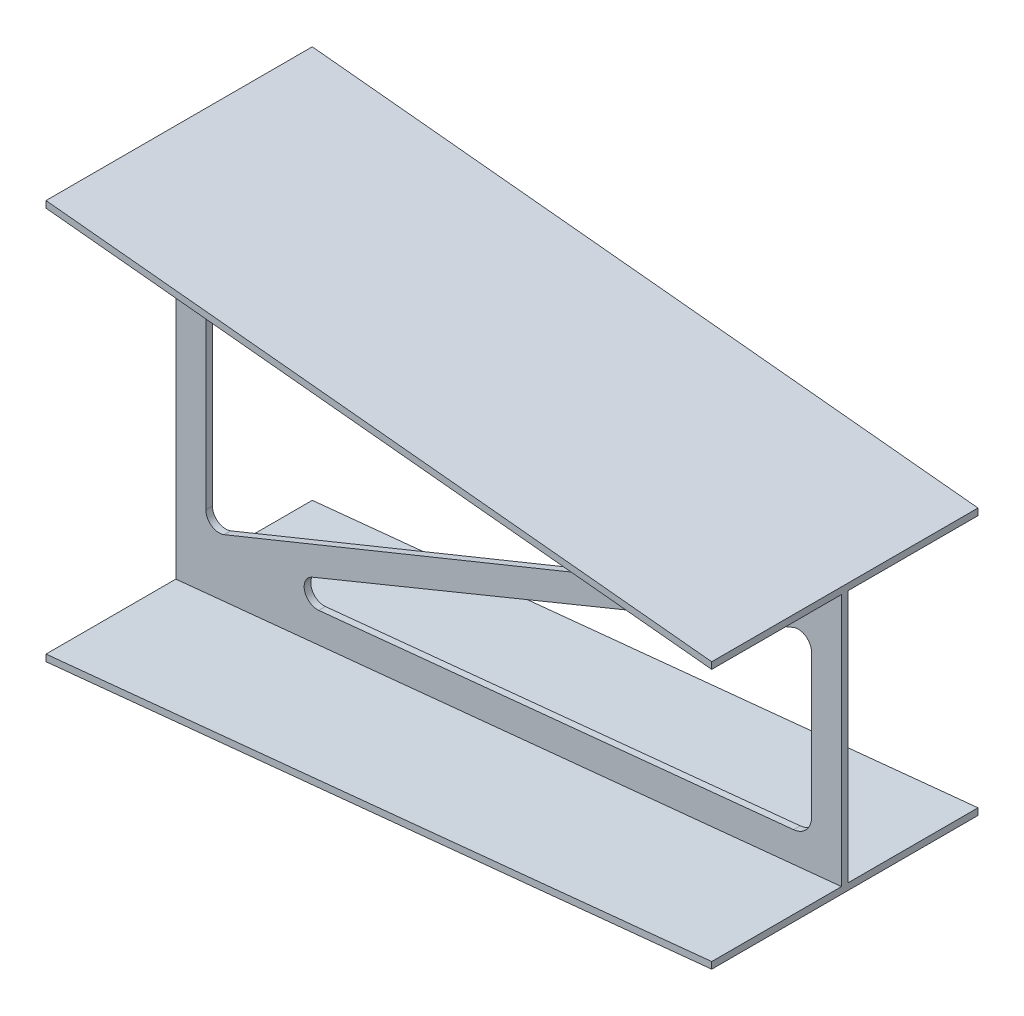
ISO-10303-21;
HEADER;
FILE_DESCRIPTION(('STEP AP214'),'2;1');
FILE_NAME('part.step','',(''),(''),'','','');
FILE_SCHEMA(('AUTOMOTIVE_DESIGN { 1 0 10303 214 1 1 1 1 }'));
ENDSEC;
DATA;
#1=APPLICATION_CONTEXT('core data for automotive mechanical design processes');
#2=APPLICATION_PROTOCOL_DEFINITION('international standard','automotive_design',2000,#1);
#3=PRODUCT_CONTEXT('',#1,'mechanical');
#4=PRODUCT('Part','Part','',(#3));
#5=PRODUCT_RELATED_PRODUCT_CATEGORY('part','',(#4));
#6=PRODUCT_DEFINITION_FORMATION('','',#4);
#7=PRODUCT_DEFINITION_CONTEXT('part definition',#1,'design');
#8=PRODUCT_DEFINITION('design','',#6,#7);
#9=PRODUCT_DEFINITION_SHAPE('','',#8);
#10=(LENGTH_UNIT() NAMED_UNIT(*) SI_UNIT(.MILLI.,.METRE.));
#11=(NAMED_UNIT(*) PLANE_ANGLE_UNIT() SI_UNIT($,.RADIAN.));
#12=(NAMED_UNIT(*) SI_UNIT($,.STERADIAN.) SOLID_ANGLE_UNIT());
#13=UNCERTAINTY_MEASURE_WITH_UNIT(LENGTH_MEASURE(1.E-05),#10,'distance_accuracy_value','');
#14=(GEOMETRIC_REPRESENTATION_CONTEXT(3) GLOBAL_UNCERTAINTY_ASSIGNED_CONTEXT((#13)) GLOBAL_UNIT_ASSIGNED_CONTEXT((#10,
#11,#12)) REPRESENTATION_CONTEXT('',''));
#15=CARTESIAN_POINT('',(0.,0.,0.));
#16=DIRECTION('',(0.,0.,1.));
#17=DIRECTION('',(1.,0.,0.));
#18=AXIS2_PLACEMENT_3D('',#15,#16,#17);
#19=CARTESIAN_POINT('',(0.,0.,10.0000000000001));
#20=DIRECTION('',(0.,0.,1.));
#21=DIRECTION('',(1.,0.,0.));
#22=AXIS2_PLACEMENT_3D('',#19,#20,#21);
#23=PLANE('',#22);
#24=DIRECTION('',(0.,-1.,0.));
#25=VECTOR('',#24,1.);
#26=CARTESIAN_POINT('',(45.0000000000001,0.,10.0000000000002));
#27=LINE('',#26,#25);
#28=CARTESIAN_POINT('',(45.,207.125932841593,10.0000000000002));
#29=VERTEX_POINT('',#28);
#30=CARTESIAN_POINT('',(45.0000000000002,-177.401369053888,10.0000000000002));
#31=VERTEX_POINT('',#30);
#32=EDGE_CURVE('E390',#29,#31,#27,.T.);
#33=ORIENTED_EDGE('',*,*,#32,.F.);
#34=CARTESIAN_POINT('',(75.,207.125932841593,10.0000000000002));
#35=DIRECTION('',(0.,0.,1.));
#36=DIRECTION('',(1.,0.,0.));
#37=AXIS2_PLACEMENT_3D('',#34,#35,#36);
#38=CIRCLE('',#37,30.);
#39=CARTESIAN_POINT('',(77.9851115706299,236.977048547893,10.0000000000002));
#40=VERTEX_POINT('',#39);
#41=EDGE_CURVE('E387',#40,#29,#38,.T.);
#42=ORIENTED_EDGE('',*,*,#41,.F.);
#43=DIRECTION('',(-0.995037190209989,0.0995037190209982,0.));
#44=VECTOR('',#43,1.);
#45=CARTESIAN_POINT('',(24.2352039311836,242.352039311838,10.0000000000001));
#46=LINE('',#45,#44);
#47=CARTESIAN_POINT('',(847.695467731229,160.006012931834,10.0000000000002));
#48=VERTEX_POINT('',#47);
#49=EDGE_CURVE('E384',#48,#40,#46,.T.);
#50=ORIENTED_EDGE('',*,*,#49,.F.);
#51=CARTESIAN_POINT('',(845.705393350809,140.105269127634,10.0000000000002));
#52=DIRECTION('',(0.,0.,1.));
#53=DIRECTION('',(1.,0.,0.));
#54=AXIS2_PLACEMENT_3D('',#51,#52,#53);
#55=CIRCLE('',#54,20.);
#56=CARTESIAN_POINT('',(853.239962448429,121.578794327684,10.0000000000002));
#57=VERTEX_POINT('',#56);
#58=EDGE_CURVE('E381',#57,#48,#55,.T.);
#59=ORIENTED_EDGE('',*,*,#58,.F.);
#60=DIRECTION('',(0.926323739997497,0.376728454881033,0.));
#61=VECTOR('',#60,1.);
#62=CARTESIAN_POINT('',(78.6678517290491,-193.433486871156,10.0000000000002));
#63=LINE('',#62,#61);
#64=CARTESIAN_POINT('',(72.5345690976208,-195.927843853838,10.0000000000002));
#65=VERTEX_POINT('',#64);
#66=EDGE_CURVE('E378',#65,#57,#63,.T.);
#67=ORIENTED_EDGE('',*,*,#66,.F.);
#68=CARTESIAN_POINT('',(65.0000000000002,-177.401369053888,10.0000000000002));
#69=DIRECTION('',(0.,0.,1.));
#70=DIRECTION('',(1.,0.,0.));
#71=AXIS2_PLACEMENT_3D('',#68,#69,#70);
#72=CIRCLE('',#71,20.);
#73=EDGE_CURVE('E321',#31,#65,#72,.T.);
#74=ORIENTED_EDGE('',*,*,#73,.F.);
#75=EDGE_LOOP('',(#33,#42,#50,#59,#67,#74));
#76=FACE_BOUND('',#75,.T.);
#77=DIRECTION('',(0.995037190209989,0.0995037190209988,0.));
#78=VECTOR('',#77,1.);
#79=CARTESIAN_POINT('',(0.,-290.,10.0000000000001));
#80=LINE('',#79,#78);
#81=CARTESIAN_POINT('',(0.,-290.,10.0000000000001));
#82=VERTEX_POINT('',#81);
#83=CARTESIAN_POINT('',(1000.,-190.,10.0000000000002));
#84=VERTEX_POINT('',#83);
#85=EDGE_CURVE('E511',#82,#84,#80,.T.);
#86=ORIENTED_EDGE('',*,*,#85,.T.);
#87=DIRECTION('',(0.,1.,0.));
#88=VECTOR('',#87,1.);
#89=CARTESIAN_POINT('',(1000.,190.,10.0000000000002));
#90=LINE('',#89,#88);
#91=CARTESIAN_POINT('',(1000.,190.,10.0000000000002));
#92=VERTEX_POINT('',#91);
#93=EDGE_CURVE('E1156',#84,#92,#90,.T.);
#94=ORIENTED_EDGE('',*,*,#93,.T.);
#95=DIRECTION('',(0.995037190209989,-0.0995037190209988,0.));
#96=VECTOR('',#95,1.);
#97=CARTESIAN_POINT('',(0.,290.,10.0000000000001));
#98=LINE('',#97,#96);
#99=CARTESIAN_POINT('',(0.,290.,10.0000000000001));
#100=VERTEX_POINT('',#99);
#101=EDGE_CURVE('E502',#100,#92,#98,.T.);
#102=ORIENTED_EDGE('',*,*,#101,.F.);
#103=DIRECTION('',(0.,-1.,0.));
#104=VECTOR('',#103,1.);
#105=CARTESIAN_POINT('',(0.,290.,10.0000000000001));
#106=LINE('',#105,#104);
#107=EDGE_CURVE('E519',#100,#82,#106,.T.);
#108=ORIENTED_EDGE('',*,*,#107,.T.);
#109=EDGE_LOOP('',(#86,#94,#102,#108));
#110=FACE_BOUND('',#109,.T.);
#111=CARTESIAN_POINT('',(925.,-122.125932841594,10.0000000000002));
#112=DIRECTION('',(0.,0.,1.));
#113=DIRECTION('',(1.,0.,0.));
#114=AXIS2_PLACEMENT_3D('',#111,#112,#113);
#115=CIRCLE('',#114,30.);
#116=CARTESIAN_POINT('',(955.,-122.125932841594,10.0000000000002));
#117=VERTEX_POINT('',#116);
#118=CARTESIAN_POINT('',(927.98511157063,-151.977048547894,10.0000000000002));
#119=VERTEX_POINT('',#118);
#120=EDGE_CURVE('E406',#117,#119,#115,.F.);
#121=ORIENTED_EDGE('',*,*,#120,.T.);
#122=DIRECTION('',(-0.995037190209989,-0.0995037190209976,0.));
#123=VECTOR('',#122,1.);
#124=CARTESIAN_POINT('',(24.2352039311834,-242.352039311837,10.0000000000001));
#125=LINE('',#124,#123);
#126=CARTESIAN_POINT('',(214.762635295755,-223.29929617538,10.0000000000002));
#127=VERTEX_POINT('',#126);
#128=EDGE_CURVE('E410',#119,#127,#125,.T.);
#129=ORIENTED_EDGE('',*,*,#128,.T.);
#130=CARTESIAN_POINT('',(212.772560915335,-203.39855237118,10.0000000000002));
#131=DIRECTION('',(0.,0.,1.));
#132=DIRECTION('',(1.,0.,0.));
#133=AXIS2_PLACEMENT_3D('',#130,#131,#132);
#134=CIRCLE('',#133,20.);
#135=CARTESIAN_POINT('',(205.194043996068,-184.890011604702,10.0000000000002));
#136=VERTEX_POINT('',#135);
#137=EDGE_CURVE('E393',#127,#136,#134,.F.);
#138=ORIENTED_EDGE('',*,*,#137,.T.);
#139=DIRECTION('',(0.925427038323906,0.378925845963355,0.));
#140=VECTOR('',#139,1.);
#141=CARTESIAN_POINT('',(94.297796988303,-230.29764772444,10.0000000000002));
#142=LINE('',#141,#140);
#143=CARTESIAN_POINT('',(927.421483080733,110.833618676044,10.0000000000002));
#144=VERTEX_POINT('',#143);
#145=EDGE_CURVE('E240',#136,#144,#142,.T.);
#146=ORIENTED_EDGE('',*,*,#145,.T.);
#147=CARTESIAN_POINT('',(935.,92.3250779095655,10.0000000000002));
#148=DIRECTION('',(0.,0.,1.));
#149=DIRECTION('',(1.,0.,0.));
#150=AXIS2_PLACEMENT_3D('',#147,#148,#149);
#151=CIRCLE('',#150,20.);
#152=CARTESIAN_POINT('',(955.000000000001,92.3250779095655,10.0000000000002));
#153=VERTEX_POINT('',#152);
#154=EDGE_CURVE('E398',#144,#153,#151,.F.);
#155=ORIENTED_EDGE('',*,*,#154,.T.);
#156=DIRECTION('',(0.,-1.,0.));
#157=VECTOR('',#156,1.);
#158=CARTESIAN_POINT('',(955.,-2.47204008226222E-12,10.0000000000002));
#159=LINE('',#158,#157);
#160=EDGE_CURVE('E402',#153,#117,#159,.T.);
#161=ORIENTED_EDGE('',*,*,#160,.T.);
#162=EDGE_LOOP('',(#121,#129,#138,#146,#155,#161));
#163=FACE_BOUND('',#162,.T.);
#164=ADVANCED_FACE('F69',(#76,#110,#163),#23,.T.);
#165=CARTESIAN_POINT('',(0.,0.,-1.57859836313889E-13));
#166=DIRECTION('',(0.,0.,-1.));
#167=DIRECTION('',(-1.,0.,0.));
#168=AXIS2_PLACEMENT_3D('',#165,#166,#167);
#169=PLANE('',#168);
#170=DIRECTION('',(0.,-1.,0.));
#171=VECTOR('',#170,1.);
#172=CARTESIAN_POINT('',(45.0000000000002,-177.401369053888,-1.30772129236512E-13));
#173=LINE('',#172,#171);
#174=CARTESIAN_POINT('',(45.,207.125932841593,-1.29378568044144E-13));
#175=VERTEX_POINT('',#174);
#176=CARTESIAN_POINT('',(45.0000000000002,-177.401369053888,-1.3138506486469E-13));
#177=VERTEX_POINT('',#176);
#178=EDGE_CURVE('E309',#175,#177,#173,.T.);
#179=ORIENTED_EDGE('',*,*,#178,.T.);
#180=CARTESIAN_POINT('',(65.0000000000002,-177.401369053888,-1.18733148313232E-13));
#181=DIRECTION('',(0.,0.,1.));
#182=DIRECTION('',(1.,0.,0.));
#183=AXIS2_PLACEMENT_3D('',#180,#181,#182);
#184=CIRCLE('',#183,20.);
#185=CARTESIAN_POINT('',(72.5345690976208,-195.927843853838,-1.14197721631663E-13));
#186=VERTEX_POINT('',#185);
#187=EDGE_CURVE('E317',#177,#186,#184,.T.);
#188=ORIENTED_EDGE('',*,*,#187,.T.);
#189=DIRECTION('',(0.926323739997497,0.376728454881033,0.));
#190=VECTOR('',#189,1.);
#191=CARTESIAN_POINT('',(72.5345690976208,-195.927843853838,-1.14197721631663E-13));
#192=LINE('',#191,#190);
#193=CARTESIAN_POINT('',(853.239962448429,121.578794327684,3.52723527443196E-13));
#194=VERTEX_POINT('',#193);
#195=EDGE_CURVE('E322',#186,#194,#192,.T.);
#196=ORIENTED_EDGE('',*,*,#195,.T.);
#197=CARTESIAN_POINT('',(845.705393350809,140.105269127634,3.5121171854934E-13));
#198=DIRECTION('',(0.,0.,1.));
#199=DIRECTION('',(-1.,0.,0.));
#200=AXIS2_PLACEMENT_3D('',#197,#198,#199);
#201=CIRCLE('',#200,20.);
#202=CARTESIAN_POINT('',(847.695467731229,160.006012931834,3.52010334132733E-13));
#203=VERTEX_POINT('',#202);
#204=EDGE_CURVE('E329',#194,#203,#201,.T.);
#205=ORIENTED_EDGE('',*,*,#204,.T.);
#206=DIRECTION('',(-0.995037190209989,0.0995037190209982,0.));
#207=VECTOR('',#206,1.);
#208=CARTESIAN_POINT('',(77.9851115706299,236.977048547893,-1.10916772788959E-13));
#209=LINE('',#208,#207);
#210=CARTESIAN_POINT('',(77.9851115706299,236.977048547893,-1.11194101831607E-13));
#211=VERTEX_POINT('',#210);
#212=EDGE_CURVE('E341',#203,#211,#209,.T.);
#213=ORIENTED_EDGE('',*,*,#212,.T.);
#214=CARTESIAN_POINT('',(75.,207.125932841593,-1.12713657851593E-13));
#215=DIRECTION('',(0.,0.,1.));
#216=DIRECTION('',(-1.,0.,0.));
#217=AXIS2_PLACEMENT_3D('',#214,#215,#216);
#218=CIRCLE('',#217,30.);
#219=EDGE_CURVE('E353',#211,#175,#218,.T.);
#220=ORIENTED_EDGE('',*,*,#219,.T.);
#221=EDGE_LOOP('',(#179,#188,#196,#205,#213,#220));
#222=FACE_BOUND('',#221,.T.);
#223=DIRECTION('',(0.995037190209989,-0.0995037190209988,0.));
#224=VECTOR('',#223,1.);
#225=CARTESIAN_POINT('',(0.,290.,-1.57859836313889E-13));
#226=LINE('',#225,#224);
#227=CARTESIAN_POINT('',(0.,290.,-1.57859836313889E-13));
#228=VERTEX_POINT('',#227);
#229=CARTESIAN_POINT('',(1000.,190.,4.44089209850063E-13));
#230=VERTEX_POINT('',#229);
#231=EDGE_CURVE('E660',#228,#230,#226,.T.);
#232=ORIENTED_EDGE('',*,*,#231,.T.);
#233=DIRECTION('',(0.,-1.,0.));
#234=VECTOR('',#233,1.);
#235=CARTESIAN_POINT('',(1000.,190.,4.44089209850063E-13));
#236=LINE('',#235,#234);
#237=CARTESIAN_POINT('',(1000.,-190.,4.44089209850063E-13));
#238=VERTEX_POINT('',#237);
#239=EDGE_CURVE('E870',#230,#238,#236,.T.);
#240=ORIENTED_EDGE('',*,*,#239,.T.);
#241=DIRECTION('',(0.995037190209989,0.0995037190209988,0.));
#242=VECTOR('',#241,1.);
#243=CARTESIAN_POINT('',(0.,-290.,-1.57859836313889E-13));
#244=LINE('',#243,#242);
#245=CARTESIAN_POINT('',(0.,-290.,-1.57859836313889E-13));
#246=VERTEX_POINT('',#245);
#247=EDGE_CURVE('E639',#246,#238,#244,.T.);
#248=ORIENTED_EDGE('',*,*,#247,.F.);
#249=DIRECTION('',(0.,1.,0.));
#250=VECTOR('',#249,1.);
#251=CARTESIAN_POINT('',(0.,290.,-1.57859836313889E-13));
#252=LINE('',#251,#250);
#253=EDGE_CURVE('E667',#246,#228,#252,.T.);
#254=ORIENTED_EDGE('',*,*,#253,.T.);
#255=EDGE_LOOP('',(#232,#240,#248,#254));
#256=FACE_BOUND('',#255,.T.);
#257=CARTESIAN_POINT('',(212.772560915335,-203.39855237118,0.));
#258=DIRECTION('',(0.,0.,-1.));
#259=DIRECTION('',(-1.,0.,0.));
#260=AXIS2_PLACEMENT_3D('',#257,#258,#259);
#261=CIRCLE('',#260,20.);
#262=CARTESIAN_POINT('',(214.762635295755,-223.29929617538,0.));
#263=VERTEX_POINT('',#262);
#264=CARTESIAN_POINT('',(205.194043996068,-184.890011604702,0.));
#265=VERTEX_POINT('',#264);
#266=EDGE_CURVE('E247',#263,#265,#261,.T.);
#267=ORIENTED_EDGE('',*,*,#266,.F.);
#268=DIRECTION('',(-0.995037190209989,-0.0995037190209975,0.));
#269=VECTOR('',#268,1.);
#270=CARTESIAN_POINT('',(927.98511157063,-151.977048547894,4.007399164504E-13));
#271=LINE('',#270,#269);
#272=CARTESIAN_POINT('',(927.98511157063,-151.977048547894,4.00140954762855E-13));
#273=VERTEX_POINT('',#272);
#274=EDGE_CURVE('E303',#273,#263,#271,.T.);
#275=ORIENTED_EDGE('',*,*,#274,.F.);
#276=CARTESIAN_POINT('',(925.,-122.125932841594,3.98943031387766E-13));
#277=DIRECTION('',(0.,0.,-1.));
#278=DIRECTION('',(-1.,0.,0.));
#279=AXIS2_PLACEMENT_3D('',#276,#277,#278);
#280=CIRCLE('',#279,30.);
#281=CARTESIAN_POINT('',(955.,-122.125932841594,4.04962521849406E-13));
#282=VERTEX_POINT('',#281);
#283=EDGE_CURVE('E280',#282,#273,#280,.T.);
#284=ORIENTED_EDGE('',*,*,#283,.F.);
#285=DIRECTION('',(0.,-1.,0.));
#286=VECTOR('',#285,1.);
#287=CARTESIAN_POINT('',(955.000000000001,92.3250779095655,4.17001502772685E-13));
#288=LINE('',#287,#286);
#289=CARTESIAN_POINT('',(955.000000000001,92.3250779095655,4.12988509131592E-13));
#290=VERTEX_POINT('',#289);
#291=EDGE_CURVE('E269',#290,#282,#288,.T.);
#292=ORIENTED_EDGE('',*,*,#291,.F.);
#293=CARTESIAN_POINT('',(935.,92.3250779095655,4.04962521849406E-13));
#294=DIRECTION('',(0.,0.,-1.));
#295=DIRECTION('',(-1.,0.,0.));
#296=AXIS2_PLACEMENT_3D('',#293,#294,#295);
#297=CIRCLE('',#296,20.);
#298=CARTESIAN_POINT('',(927.421483080733,110.833618676044,4.03441894839109E-13));
#299=VERTEX_POINT('',#298);
#300=EDGE_CURVE('E243',#299,#290,#297,.T.);
#301=ORIENTED_EDGE('',*,*,#300,.F.);
#302=DIRECTION('',(0.925427038323906,0.378925845963355,0.));
#303=VECTOR('',#302,1.);
#304=CARTESIAN_POINT('',(927.421483080733,110.833618676044,4.00400640818516E-13));
#305=LINE('',#304,#303);
#306=EDGE_CURVE('E237',#265,#299,#305,.T.);
#307=ORIENTED_EDGE('',*,*,#306,.F.);
#308=EDGE_LOOP('',(#267,#275,#284,#292,#301,#307));
#309=FACE_BOUND('',#308,.T.);
#310=ADVANCED_FACE('F256',(#222,#256,#309),#169,.T.);
#311=CARTESIAN_POINT('',(1000.,0.,0.));
#312=DIRECTION('',(-1.,0.,0.));
#313=DIRECTION('',(0.,0.,1.));
#314=AXIS2_PLACEMENT_3D('',#311,#312,#313);
#315=PLANE('',#314);
#316=DIRECTION('',(0.,-1.,0.));
#317=VECTOR('',#316,1.);
#318=CARTESIAN_POINT('',(1000.,200.,-195.));
#319=LINE('',#318,#317);
#320=CARTESIAN_POINT('',(1000.,200.,-195.));
#321=VERTEX_POINT('',#320);
#322=CARTESIAN_POINT('',(1000.,190.,-195.));
#323=VERTEX_POINT('',#322);
#324=EDGE_CURVE('E713',#321,#323,#319,.T.);
#325=ORIENTED_EDGE('',*,*,#324,.F.);
#326=DIRECTION('',(0.,0.,-1.));
#327=VECTOR('',#326,1.);
#328=CARTESIAN_POINT('',(1000.,200.,-195.));
#329=LINE('',#328,#327);
#330=CARTESIAN_POINT('',(1000.,200.,205.));
#331=VERTEX_POINT('',#330);
#332=EDGE_CURVE('E13',#331,#321,#329,.T.);
#333=ORIENTED_EDGE('',*,*,#332,.F.);
#334=DIRECTION('',(0.,1.,0.));
#335=VECTOR('',#334,1.);
#336=CARTESIAN_POINT('',(1000.,200.,205.));
#337=LINE('',#336,#335);
#338=CARTESIAN_POINT('',(1000.,190.,205.));
#339=VERTEX_POINT('',#338);
#340=EDGE_CURVE('E81',#339,#331,#337,.T.);
#341=ORIENTED_EDGE('',*,*,#340,.F.);
#342=DIRECTION('',(0.,0.,1.));
#343=VECTOR('',#342,1.);
#344=CARTESIAN_POINT('',(1000.,190.,10.0000000000002));
#345=LINE('',#344,#343);
#346=EDGE_CURVE('E471',#92,#339,#345,.T.);
#347=ORIENTED_EDGE('',*,*,#346,.F.);
#348=ORIENTED_EDGE('',*,*,#93,.F.);
#349=DIRECTION('',(0.,0.,-1.));
#350=VECTOR('',#349,1.);
#351=CARTESIAN_POINT('',(1000.,-190.,10.0000000000002));
#352=LINE('',#351,#350);
#353=CARTESIAN_POINT('',(1000.,-190.,205.));
#354=VERTEX_POINT('',#353);
#355=EDGE_CURVE('E1146',#354,#84,#352,.T.);
#356=ORIENTED_EDGE('',*,*,#355,.F.);
#357=DIRECTION('',(0.,1.,0.));
#358=VECTOR('',#357,1.);
#359=CARTESIAN_POINT('',(1000.,-190.,205.));
#360=LINE('',#359,#358);
#361=CARTESIAN_POINT('',(1000.,-200.,205.));
#362=VERTEX_POINT('',#361);
#363=EDGE_CURVE('E1137',#362,#354,#360,.T.);
#364=ORIENTED_EDGE('',*,*,#363,.F.);
#365=DIRECTION('',(0.,0.,1.));
#366=VECTOR('',#365,1.);
#367=CARTESIAN_POINT('',(1000.,-200.,-195.));
#368=LINE('',#367,#366);
#369=CARTESIAN_POINT('',(1000.,-200.,-195.));
#370=VERTEX_POINT('',#369);
#371=EDGE_CURVE('E591',#370,#362,#368,.T.);
#372=ORIENTED_EDGE('',*,*,#371,.F.);
#373=DIRECTION('',(0.,-1.,0.));
#374=VECTOR('',#373,1.);
#375=CARTESIAN_POINT('',(1000.,-190.,-195.));
#376=LINE('',#375,#374);
#377=CARTESIAN_POINT('',(1000.,-190.,-195.));
#378=VERTEX_POINT('',#377);
#379=EDGE_CURVE('E605',#378,#370,#376,.T.);
#380=ORIENTED_EDGE('',*,*,#379,.F.);
#381=DIRECTION('',(0.,0.,-1.));
#382=VECTOR('',#381,1.);
#383=CARTESIAN_POINT('',(1000.,-190.,-195.));
#384=LINE('',#383,#382);
#385=EDGE_CURVE('E1112',#238,#378,#384,.T.);
#386=ORIENTED_EDGE('',*,*,#385,.F.);
#387=ORIENTED_EDGE('',*,*,#239,.F.);
#388=DIRECTION('',(0.,0.,1.));
#389=VECTOR('',#388,1.);
#390=CARTESIAN_POINT('',(1000.,190.,-195.));
#391=LINE('',#390,#389);
#392=EDGE_CURVE('E699',#323,#230,#391,.T.);
#393=ORIENTED_EDGE('',*,*,#392,.F.);
#394=EDGE_LOOP('',(#325,#333,#341,#347,#348,#356,#364,#372,#380,#386,#387,#393));
#395=FACE_BOUND('',#394,.T.);
#396=ADVANCED_FACE('F71',(#395),#315,.F.);
#397=CARTESIAN_POINT('',(0.,0.,0.));
#398=DIRECTION('',(1.,0.,0.));
#399=DIRECTION('',(0.,0.,-1.));
#400=AXIS2_PLACEMENT_3D('',#397,#398,#399);
#401=PLANE('',#400);
#402=DIRECTION('',(0.,-1.,0.));
#403=VECTOR('',#402,1.);
#404=CARTESIAN_POINT('',(0.,300.,205.));
#405=LINE('',#404,#403);
#406=CARTESIAN_POINT('',(0.,300.,205.));
#407=VERTEX_POINT('',#406);
#408=CARTESIAN_POINT('',(0.,290.,205.));
#409=VERTEX_POINT('',#408);
#410=EDGE_CURVE('E414',#407,#409,#405,.T.);
#411=ORIENTED_EDGE('',*,*,#410,.F.);
#412=DIRECTION('',(0.,0.,1.));
#413=VECTOR('',#412,1.);
#414=CARTESIAN_POINT('',(0.,300.,205.));
#415=LINE('',#414,#413);
#416=CARTESIAN_POINT('',(0.,300.,-195.));
#417=VERTEX_POINT('',#416);
#418=EDGE_CURVE('E420',#417,#407,#415,.T.);
#419=ORIENTED_EDGE('',*,*,#418,.F.);
#420=DIRECTION('',(0.,1.,0.));
#421=VECTOR('',#420,1.);
#422=CARTESIAN_POINT('',(0.,300.,-195.));
#423=LINE('',#422,#421);
#424=CARTESIAN_POINT('',(0.,290.,-195.));
#425=VERTEX_POINT('',#424);
#426=EDGE_CURVE('E729',#425,#417,#423,.T.);
#427=ORIENTED_EDGE('',*,*,#426,.F.);
#428=DIRECTION('',(0.,0.,-1.));
#429=VECTOR('',#428,1.);
#430=CARTESIAN_POINT('',(0.,290.,-1.57859836313889E-13));
#431=LINE('',#430,#429);
#432=EDGE_CURVE('E843',#228,#425,#431,.T.);
#433=ORIENTED_EDGE('',*,*,#432,.F.);
#434=ORIENTED_EDGE('',*,*,#253,.F.);
#435=DIRECTION('',(0.,0.,1.));
#436=VECTOR('',#435,1.);
#437=CARTESIAN_POINT('',(0.,-290.,-1.57859836313889E-13));
#438=LINE('',#437,#436);
#439=CARTESIAN_POINT('',(0.,-290.,-195.));
#440=VERTEX_POINT('',#439);
#441=EDGE_CURVE('E648',#440,#246,#438,.T.);
#442=ORIENTED_EDGE('',*,*,#441,.F.);
#443=DIRECTION('',(0.,1.,0.));
#444=VECTOR('',#443,1.);
#445=CARTESIAN_POINT('',(0.,-290.,-195.));
#446=LINE('',#445,#444);
#447=CARTESIAN_POINT('',(0.,-300.,-195.));
#448=VERTEX_POINT('',#447);
#449=EDGE_CURVE('E833',#448,#440,#446,.T.);
#450=ORIENTED_EDGE('',*,*,#449,.F.);
#451=DIRECTION('',(0.,0.,-1.));
#452=VECTOR('',#451,1.);
#453=CARTESIAN_POINT('',(0.,-300.,205.));
#454=LINE('',#453,#452);
#455=CARTESIAN_POINT('',(0.,-300.,205.));
#456=VERTEX_POINT('',#455);
#457=EDGE_CURVE('E828',#456,#448,#454,.T.);
#458=ORIENTED_EDGE('',*,*,#457,.F.);
#459=DIRECTION('',(0.,-1.,0.));
#460=VECTOR('',#459,1.);
#461=CARTESIAN_POINT('',(0.,-290.,205.));
#462=LINE('',#461,#460);
#463=CARTESIAN_POINT('',(0.,-290.,205.));
#464=VERTEX_POINT('',#463);
#465=EDGE_CURVE('E556',#464,#456,#462,.T.);
#466=ORIENTED_EDGE('',*,*,#465,.F.);
#467=DIRECTION('',(0.,0.,1.));
#468=VECTOR('',#467,1.);
#469=CARTESIAN_POINT('',(0.,-290.,205.));
#470=LINE('',#469,#468);
#471=EDGE_CURVE('E537',#82,#464,#470,.T.);
#472=ORIENTED_EDGE('',*,*,#471,.F.);
#473=ORIENTED_EDGE('',*,*,#107,.F.);
#474=DIRECTION('',(0.,0.,-1.));
#475=VECTOR('',#474,1.);
#476=CARTESIAN_POINT('',(0.,290.,205.));
#477=LINE('',#476,#475);
#478=EDGE_CURVE('E812',#409,#100,#477,.T.);
#479=ORIENTED_EDGE('',*,*,#478,.F.);
#480=EDGE_LOOP('',(#411,#419,#427,#433,#434,#442,#450,#458,#466,#472,#473,#479));
#481=FACE_BOUND('',#480,.T.);
#482=ADVANCED_FACE('F489',(#481),#401,.F.);
#483=CARTESIAN_POINT('',(28.7128712871287,287.128712871287,0.));
#484=DIRECTION('',(-0.0995037190209988,-0.995037190209989,0.));
#485=DIRECTION('',(0.995037190209989,-0.0995037190209988,0.));
#486=AXIS2_PLACEMENT_3D('',#483,#484,#485);
#487=PLANE('',#486);
#488=ORIENTED_EDGE('',*,*,#101,.T.);
#489=ORIENTED_EDGE('',*,*,#346,.T.);
#490=DIRECTION('',(0.995037190209989,-0.0995037190209988,0.));
#491=VECTOR('',#490,1.);
#492=CARTESIAN_POINT('',(0.,290.,205.));
#493=LINE('',#492,#491);
#494=EDGE_CURVE('E856',#409,#339,#493,.T.);
#495=ORIENTED_EDGE('',*,*,#494,.F.);
#496=ORIENTED_EDGE('',*,*,#478,.T.);
#497=EDGE_LOOP('',(#488,#489,#495,#496));
#498=FACE_BOUND('',#497,.T.);
#499=ADVANCED_FACE('F478',(#498),#487,.T.);
#500=CARTESIAN_POINT('',(28.7128712871287,-287.128712871287,0.));
#501=DIRECTION('',(-0.0995037190209989,0.995037190209989,0.));
#502=DIRECTION('',(-0.995037190209989,-0.0995037190209989,0.));
#503=AXIS2_PLACEMENT_3D('',#500,#501,#502);
#504=PLANE('',#503);
#505=DIRECTION('',(0.995037190209989,0.0995037190209989,0.));
#506=VECTOR('',#505,1.);
#507=CARTESIAN_POINT('',(0.,-290.,205.));
#508=LINE('',#507,#506);
#509=EDGE_CURVE('E510',#464,#354,#508,.T.);
#510=ORIENTED_EDGE('',*,*,#509,.T.);
#511=ORIENTED_EDGE('',*,*,#355,.T.);
#512=ORIENTED_EDGE('',*,*,#85,.F.);
#513=ORIENTED_EDGE('',*,*,#471,.T.);
#514=EDGE_LOOP('',(#510,#511,#512,#513));
#515=FACE_BOUND('',#514,.T.);
#516=ADVANCED_FACE('F488',(#515),#504,.T.);
#517=CARTESIAN_POINT('',(0.,0.,205.));
#518=DIRECTION('',(0.,0.,1.));
#519=DIRECTION('',(1.,0.,0.));
#520=AXIS2_PLACEMENT_3D('',#517,#518,#519);
#521=PLANE('',#520);
#522=DIRECTION('',(0.995037190209989,0.0995037190209989,0.));
#523=VECTOR('',#522,1.);
#524=CARTESIAN_POINT('',(0.,-300.,205.));
#525=LINE('',#524,#523);
#526=EDGE_CURVE('E549',#456,#362,#525,.T.);
#527=ORIENTED_EDGE('',*,*,#526,.T.);
#528=ORIENTED_EDGE('',*,*,#363,.T.);
#529=ORIENTED_EDGE('',*,*,#509,.F.);
#530=ORIENTED_EDGE('',*,*,#465,.T.);
#531=EDGE_LOOP('',(#527,#528,#529,#530));
#532=FACE_BOUND('',#531,.T.);
#533=ADVANCED_FACE('F562',(#532),#521,.T.);
#534=CARTESIAN_POINT('',(29.7029702970297,-297.029702970297,0.));
#535=DIRECTION('',(0.0995037190209988,-0.995037190209989,0.));
#536=DIRECTION('',(0.995037190209989,0.0995037190209988,0.));
#537=AXIS2_PLACEMENT_3D('',#534,#535,#536);
#538=PLANE('',#537);
#539=DIRECTION('',(0.995037190209989,0.0995037190209988,0.));
#540=VECTOR('',#539,1.);
#541=CARTESIAN_POINT('',(0.,-300.,-195.));
#542=LINE('',#541,#540);
#543=EDGE_CURVE('E640',#448,#370,#542,.T.);
#544=ORIENTED_EDGE('',*,*,#543,.T.);
#545=ORIENTED_EDGE('',*,*,#371,.T.);
#546=ORIENTED_EDGE('',*,*,#526,.F.);
#547=ORIENTED_EDGE('',*,*,#457,.T.);
#548=EDGE_LOOP('',(#544,#545,#546,#547));
#549=FACE_BOUND('',#548,.T.);
#550=ADVANCED_FACE('F571',(#549),#538,.T.);
#551=CARTESIAN_POINT('',(0.,0.,-195.));
#552=DIRECTION('',(0.,0.,-1.));
#553=DIRECTION('',(-1.,0.,0.));
#554=AXIS2_PLACEMENT_3D('',#551,#552,#553);
#555=PLANE('',#554);
#556=DIRECTION('',(0.995037190209989,0.0995037190209988,0.));
#557=VECTOR('',#556,1.);
#558=CARTESIAN_POINT('',(0.,-290.,-195.));
#559=LINE('',#558,#557);
#560=EDGE_CURVE('E631',#440,#378,#559,.T.);
#561=ORIENTED_EDGE('',*,*,#560,.T.);
#562=ORIENTED_EDGE('',*,*,#379,.T.);
#563=ORIENTED_EDGE('',*,*,#543,.F.);
#564=ORIENTED_EDGE('',*,*,#449,.T.);
#565=EDGE_LOOP('',(#561,#562,#563,#564));
#566=FACE_BOUND('',#565,.T.);
#567=ADVANCED_FACE('F611',(#566),#555,.T.);
#568=CARTESIAN_POINT('',(28.7128712871287,-287.128712871287,0.));
#569=DIRECTION('',(-0.0995037190209988,0.995037190209989,0.));
#570=DIRECTION('',(-0.995037190209989,-0.0995037190209988,0.));
#571=AXIS2_PLACEMENT_3D('',#568,#569,#570);
#572=PLANE('',#571);
#573=ORIENTED_EDGE('',*,*,#247,.T.);
#574=ORIENTED_EDGE('',*,*,#385,.T.);
#575=ORIENTED_EDGE('',*,*,#560,.F.);
#576=ORIENTED_EDGE('',*,*,#441,.T.);
#577=EDGE_LOOP('',(#573,#574,#575,#576));
#578=FACE_BOUND('',#577,.T.);
#579=ADVANCED_FACE('F620',(#578),#572,.T.);
#580=CARTESIAN_POINT('',(28.7128712871287,287.128712871287,0.));
#581=DIRECTION('',(-0.099503719020999,-0.995037190209989,0.));
#582=DIRECTION('',(0.995037190209989,-0.099503719020999,0.));
#583=AXIS2_PLACEMENT_3D('',#580,#581,#582);
#584=PLANE('',#583);
#585=DIRECTION('',(0.995037190209989,-0.099503719020999,0.));
#586=VECTOR('',#585,1.);
#587=CARTESIAN_POINT('',(0.,290.,-195.));
#588=LINE('',#587,#586);
#589=EDGE_CURVE('E850',#425,#323,#588,.T.);
#590=ORIENTED_EDGE('',*,*,#589,.T.);
#591=ORIENTED_EDGE('',*,*,#392,.T.);
#592=ORIENTED_EDGE('',*,*,#231,.F.);
#593=ORIENTED_EDGE('',*,*,#432,.T.);
#594=EDGE_LOOP('',(#590,#591,#592,#593));
#595=FACE_BOUND('',#594,.T.);
#596=ADVANCED_FACE('F681',(#595),#584,.T.);
#597=CARTESIAN_POINT('',(0.,0.,-195.));
#598=DIRECTION('',(0.,0.,-1.));
#599=DIRECTION('',(-1.,0.,0.));
#600=AXIS2_PLACEMENT_3D('',#597,#598,#599);
#601=PLANE('',#600);
#602=DIRECTION('',(0.995037190209989,-0.099503719020999,0.));
#603=VECTOR('',#602,1.);
#604=CARTESIAN_POINT('',(0.,300.,-195.));
#605=LINE('',#604,#603);
#606=EDGE_CURVE('E426',#417,#321,#605,.T.);
#607=ORIENTED_EDGE('',*,*,#606,.T.);
#608=ORIENTED_EDGE('',*,*,#324,.T.);
#609=ORIENTED_EDGE('',*,*,#589,.F.);
#610=ORIENTED_EDGE('',*,*,#426,.T.);
#611=EDGE_LOOP('',(#607,#608,#609,#610));
#612=FACE_BOUND('',#611,.T.);
#613=ADVANCED_FACE('F438',(#612),#601,.T.);
#614=CARTESIAN_POINT('',(29.7029702970297,297.029702970297,0.));
#615=DIRECTION('',(0.0995037190209988,0.995037190209989,0.));
#616=DIRECTION('',(-0.995037190209989,0.0995037190209988,0.));
#617=AXIS2_PLACEMENT_3D('',#614,#615,#616);
#618=PLANE('',#617);
#619=DIRECTION('',(0.995037190209989,-0.0995037190209988,0.));
#620=VECTOR('',#619,1.);
#621=CARTESIAN_POINT('',(0.,300.,205.));
#622=LINE('',#621,#620);
#623=EDGE_CURVE('E853',#407,#331,#622,.T.);
#624=ORIENTED_EDGE('',*,*,#623,.T.);
#625=ORIENTED_EDGE('',*,*,#332,.T.);
#626=ORIENTED_EDGE('',*,*,#606,.F.);
#627=ORIENTED_EDGE('',*,*,#418,.T.);
#628=EDGE_LOOP('',(#624,#625,#626,#627));
#629=FACE_BOUND('',#628,.T.);
#630=ADVANCED_FACE('F428',(#629),#618,.T.);
#631=CARTESIAN_POINT('',(0.,0.,205.));
#632=DIRECTION('',(0.,0.,1.));
#633=DIRECTION('',(1.,0.,0.));
#634=AXIS2_PLACEMENT_3D('',#631,#632,#633);
#635=PLANE('',#634);
#636=ORIENTED_EDGE('',*,*,#494,.T.);
#637=ORIENTED_EDGE('',*,*,#340,.T.);
#638=ORIENTED_EDGE('',*,*,#623,.F.);
#639=ORIENTED_EDGE('',*,*,#410,.T.);
#640=EDGE_LOOP('',(#636,#637,#638,#639));
#641=FACE_BOUND('',#640,.T.);
#642=ADVANCED_FACE('F437',(#641),#635,.T.);
#643=CARTESIAN_POINT('',(45.0000000000002,-177.401369053888,-1.30772129236512E-13));
#644=DIRECTION('',(-1.,0.,0.));
#645=DIRECTION('',(0.,-1.,0.));
#646=AXIS2_PLACEMENT_3D('',#643,#644,#645);
#647=PLANE('',#646);
#648=ORIENTED_EDGE('',*,*,#32,.T.);
#649=DIRECTION('',(0.,0.,1.));
#650=VECTOR('',#649,1.);
#651=CARTESIAN_POINT('',(45.0000000000002,-177.401369053888,-1.30772129236512E-13));
#652=LINE('',#651,#650);
#653=EDGE_CURVE('E97',#177,#31,#652,.T.);
#654=ORIENTED_EDGE('',*,*,#653,.F.);
#655=ORIENTED_EDGE('',*,*,#178,.F.);
#656=DIRECTION('',(0.,0.,1.));
#657=VECTOR('',#656,1.);
#658=CARTESIAN_POINT('',(45.,207.125932841593,-1.30772129236512E-13));
#659=LINE('',#658,#657);
#660=EDGE_CURVE('E254',#175,#29,#659,.T.);
#661=ORIENTED_EDGE('',*,*,#660,.T.);
#662=EDGE_LOOP('',(#648,#654,#655,#661));
#663=FACE_BOUND('',#662,.T.);
#664=ADVANCED_FACE('F921',(#663),#647,.F.);
#665=CARTESIAN_POINT('',(75.,207.125932841593,-1.12713657851593E-13));
#666=DIRECTION('',(0.,0.,1.));
#667=DIRECTION('',(1.,0.,0.));
#668=AXIS2_PLACEMENT_3D('',#665,#666,#667);
#669=CYLINDRICAL_SURFACE('',#668,30.);
#670=ORIENTED_EDGE('',*,*,#41,.T.);
#671=ORIENTED_EDGE('',*,*,#660,.F.);
#672=ORIENTED_EDGE('',*,*,#219,.F.);
#673=DIRECTION('',(0.,0.,1.));
#674=VECTOR('',#673,1.);
#675=CARTESIAN_POINT('',(77.9851115706299,236.977048547893,-1.11332766352931E-13));
#676=LINE('',#675,#674);
#677=EDGE_CURVE('E308',#211,#40,#676,.T.);
#678=ORIENTED_EDGE('',*,*,#677,.T.);
#679=EDGE_LOOP('',(#670,#671,#672,#678));
#680=FACE_BOUND('',#679,.T.);
#681=ADVANCED_FACE('F924',(#680),#669,.F.);
#682=CARTESIAN_POINT('',(77.9851115706299,236.977048547893,-1.10916772788959E-13));
#683=DIRECTION('',(0.0995037190209982,0.995037190209989,0.));
#684=DIRECTION('',(-0.995037190209989,0.0995037190209982,0.));
#685=AXIS2_PLACEMENT_3D('',#682,#683,#684);
#686=PLANE('',#685);
#687=ORIENTED_EDGE('',*,*,#49,.T.);
#688=ORIENTED_EDGE('',*,*,#677,.F.);
#689=ORIENTED_EDGE('',*,*,#212,.F.);
#690=DIRECTION('',(0.,0.,1.));
#691=VECTOR('',#690,1.);
#692=CARTESIAN_POINT('',(847.695467731229,160.006012931834,3.52409641924429E-13));
#693=LINE('',#692,#691);
#694=EDGE_CURVE('E349',#203,#48,#693,.T.);
#695=ORIENTED_EDGE('',*,*,#694,.T.);
#696=EDGE_LOOP('',(#687,#688,#689,#695));
#697=FACE_BOUND('',#696,.T.);
#698=ADVANCED_FACE('F928',(#697),#686,.F.);
#699=CARTESIAN_POINT('',(845.705393350809,140.105269127634,3.5121171854934E-13));
#700=DIRECTION('',(0.,0.,1.));
#701=DIRECTION('',(1.,0.,0.));
#702=AXIS2_PLACEMENT_3D('',#699,#700,#701);
#703=CYLINDRICAL_SURFACE('',#702,20.);
#704=ORIENTED_EDGE('',*,*,#58,.T.);
#705=ORIENTED_EDGE('',*,*,#694,.F.);
#706=ORIENTED_EDGE('',*,*,#204,.F.);
#707=DIRECTION('',(0.,0.,1.));
#708=VECTOR('',#707,1.);
#709=CARTESIAN_POINT('',(853.239962448429,121.578794327684,3.5121171854934E-13));
#710=LINE('',#709,#708);
#711=EDGE_CURVE('E337',#194,#57,#710,.T.);
#712=ORIENTED_EDGE('',*,*,#711,.T.);
#713=EDGE_LOOP('',(#704,#705,#706,#712));
#714=FACE_BOUND('',#713,.T.);
#715=ADVANCED_FACE('F932',(#714),#703,.F.);
#716=CARTESIAN_POINT('',(72.5345690976208,-195.927843853838,-1.14197721631663E-13));
#717=DIRECTION('',(0.376728454881033,-0.926323739997496,0.));
#718=DIRECTION('',(0.926323739997497,0.376728454881033,0.));
#719=AXIS2_PLACEMENT_3D('',#716,#717,#718);
#720=PLANE('',#719);
#721=ORIENTED_EDGE('',*,*,#66,.T.);
#722=ORIENTED_EDGE('',*,*,#711,.F.);
#723=ORIENTED_EDGE('',*,*,#195,.F.);
#724=DIRECTION('',(0.,0.,1.));
#725=VECTOR('',#724,1.);
#726=CARTESIAN_POINT('',(72.5345690976208,-195.927843853838,-1.14197721631663E-13));
#727=LINE('',#726,#725);
#728=EDGE_CURVE('E325',#186,#65,#727,.T.);
#729=ORIENTED_EDGE('',*,*,#728,.T.);
#730=EDGE_LOOP('',(#721,#722,#723,#729));
#731=FACE_BOUND('',#730,.T.);
#732=ADVANCED_FACE('F909',(#731),#720,.F.);
#733=CARTESIAN_POINT('',(65.0000000000002,-177.401369053888,-1.18733148313232E-13));
#734=DIRECTION('',(0.,0.,1.));
#735=DIRECTION('',(1.,0.,0.));
#736=AXIS2_PLACEMENT_3D('',#733,#734,#735);
#737=CYLINDRICAL_SURFACE('',#736,20.);
#738=ORIENTED_EDGE('',*,*,#73,.T.);
#739=ORIENTED_EDGE('',*,*,#728,.F.);
#740=ORIENTED_EDGE('',*,*,#187,.F.);
#741=ORIENTED_EDGE('',*,*,#653,.T.);
#742=EDGE_LOOP('',(#738,#739,#740,#741));
#743=FACE_BOUND('',#742,.T.);
#744=ADVANCED_FACE('F749',(#743),#737,.F.);
#745=CARTESIAN_POINT('',(927.98511157063,-151.977048547894,4.007399164504E-13));
#746=DIRECTION('',(-0.0995037190209975,0.995037190209989,0.));
#747=DIRECTION('',(-0.995037190209989,-0.0995037190209976,0.));
#748=AXIS2_PLACEMENT_3D('',#745,#746,#747);
#749=PLANE('',#748);
#750=DIRECTION('',(0.,0.,1.));
#751=VECTOR('',#750,1.);
#752=CARTESIAN_POINT('',(927.98511157063,-151.977048547894,4.007399164504E-13));
#753=LINE('',#752,#751);
#754=EDGE_CURVE('E299',#273,#119,#753,.T.);
#755=ORIENTED_EDGE('',*,*,#754,.F.);
#756=ORIENTED_EDGE('',*,*,#274,.T.);
#757=DIRECTION('',(0.,0.,1.));
#758=VECTOR('',#757,1.);
#759=CARTESIAN_POINT('',(214.762635295755,-223.29929617538,0.));
#760=LINE('',#759,#758);
#761=EDGE_CURVE('E250',#263,#127,#760,.T.);
#762=ORIENTED_EDGE('',*,*,#761,.T.);
#763=ORIENTED_EDGE('',*,*,#128,.F.);
#764=EDGE_LOOP('',(#755,#756,#762,#763));
#765=FACE_BOUND('',#764,.T.);
#766=ADVANCED_FACE('F901',(#765),#749,.T.);
#767=CARTESIAN_POINT('',(925.,-122.125932841594,3.98943031387766E-13));
#768=DIRECTION('',(0.,0.,1.));
#769=DIRECTION('',(1.,0.,0.));
#770=AXIS2_PLACEMENT_3D('',#767,#768,#769);
#771=CYLINDRICAL_SURFACE('',#770,30.);
#772=DIRECTION('',(0.,0.,1.));
#773=VECTOR('',#772,1.);
#774=CARTESIAN_POINT('',(955.,-122.125932841594,3.98943031387766E-13));
#775=LINE('',#774,#773);
#776=EDGE_CURVE('E288',#282,#117,#775,.T.);
#777=ORIENTED_EDGE('',*,*,#776,.F.);
#778=ORIENTED_EDGE('',*,*,#283,.T.);
#779=ORIENTED_EDGE('',*,*,#754,.T.);
#780=ORIENTED_EDGE('',*,*,#120,.F.);
#781=EDGE_LOOP('',(#777,#778,#779,#780));
#782=FACE_BOUND('',#781,.T.);
#783=ADVANCED_FACE('F886',(#782),#771,.F.);
#784=CARTESIAN_POINT('',(955.000000000001,92.3250779095655,4.17001502772685E-13));
#785=DIRECTION('',(-1.,0.,0.));
#786=DIRECTION('',(0.,-1.,0.));
#787=AXIS2_PLACEMENT_3D('',#784,#785,#786);
#788=PLANE('',#787);
#789=DIRECTION('',(0.,0.,1.));
#790=VECTOR('',#789,1.);
#791=CARTESIAN_POINT('',(955.000000000001,92.3250779095655,4.17001502772685E-13));
#792=LINE('',#791,#790);
#793=EDGE_CURVE('E276',#290,#153,#792,.T.);
#794=ORIENTED_EDGE('',*,*,#793,.F.);
#795=ORIENTED_EDGE('',*,*,#291,.T.);
#796=ORIENTED_EDGE('',*,*,#776,.T.);
#797=ORIENTED_EDGE('',*,*,#160,.F.);
#798=EDGE_LOOP('',(#794,#795,#796,#797));
#799=FACE_BOUND('',#798,.T.);
#800=ADVANCED_FACE('F888',(#799),#788,.T.);
#801=CARTESIAN_POINT('',(935.,92.3250779095655,4.04962521849406E-13));
#802=DIRECTION('',(0.,0.,1.));
#803=DIRECTION('',(1.,0.,0.));
#804=AXIS2_PLACEMENT_3D('',#801,#802,#803);
#805=CYLINDRICAL_SURFACE('',#804,20.);
#806=DIRECTION('',(0.,0.,1.));
#807=VECTOR('',#806,1.);
#808=CARTESIAN_POINT('',(927.421483080733,110.833618676044,4.04962521849406E-13));
#809=LINE('',#808,#807);
#810=EDGE_CURVE('E266',#299,#144,#809,.T.);
#811=ORIENTED_EDGE('',*,*,#810,.F.);
#812=ORIENTED_EDGE('',*,*,#300,.T.);
#813=ORIENTED_EDGE('',*,*,#793,.T.);
#814=ORIENTED_EDGE('',*,*,#154,.F.);
#815=EDGE_LOOP('',(#811,#812,#813,#814));
#816=FACE_BOUND('',#815,.T.);
#817=ADVANCED_FACE('F913',(#816),#805,.F.);
#818=CARTESIAN_POINT('',(927.421483080733,110.833618676044,4.00400640818516E-13));
#819=DIRECTION('',(0.378925845963355,-0.925427038323906,0.));
#820=DIRECTION('',(0.925427038323906,0.378925845963355,0.));
#821=AXIS2_PLACEMENT_3D('',#818,#819,#820);
#822=PLANE('',#821);
#823=DIRECTION('',(0.,0.,1.));
#824=VECTOR('',#823,1.);
#825=CARTESIAN_POINT('',(205.194043996068,-184.890011604702,0.));
#826=LINE('',#825,#824);
#827=EDGE_CURVE('E89',#265,#136,#826,.T.);
#828=ORIENTED_EDGE('',*,*,#827,.F.);
#829=ORIENTED_EDGE('',*,*,#306,.T.);
#830=ORIENTED_EDGE('',*,*,#810,.T.);
#831=ORIENTED_EDGE('',*,*,#145,.F.);
#832=EDGE_LOOP('',(#828,#829,#830,#831));
#833=FACE_BOUND('',#832,.T.);
#834=ADVANCED_FACE('F234',(#833),#822,.T.);
#835=CARTESIAN_POINT('',(212.772560915335,-203.39855237118,0.));
#836=DIRECTION('',(0.,0.,1.));
#837=DIRECTION('',(1.,0.,0.));
#838=AXIS2_PLACEMENT_3D('',#835,#836,#837);
#839=CYLINDRICAL_SURFACE('',#838,20.);
#840=ORIENTED_EDGE('',*,*,#761,.F.);
#841=ORIENTED_EDGE('',*,*,#266,.T.);
#842=ORIENTED_EDGE('',*,*,#827,.T.);
#843=ORIENTED_EDGE('',*,*,#137,.F.);
#844=EDGE_LOOP('',(#840,#841,#842,#843));
#845=FACE_BOUND('',#844,.T.);
#846=ADVANCED_FACE('F248',(#845),#839,.F.);
#847=CLOSED_SHELL('',(#164,#310,#396,#482,#499,#516,#533,#550,#567,#579,#596,#613,#630,#642,
#664,#681,#698,#715,#732,#744,#766,#783,#800,#817,#834,#846));
#848=MANIFOLD_SOLID_BREP('B2',#847);
#849=ADVANCED_BREP_SHAPE_REPRESENTATION('',(#18,#848),#14);
#850=SHAPE_DEFINITION_REPRESENTATION(#9,#849);
ENDSEC;
END-ISO-10303-21;
